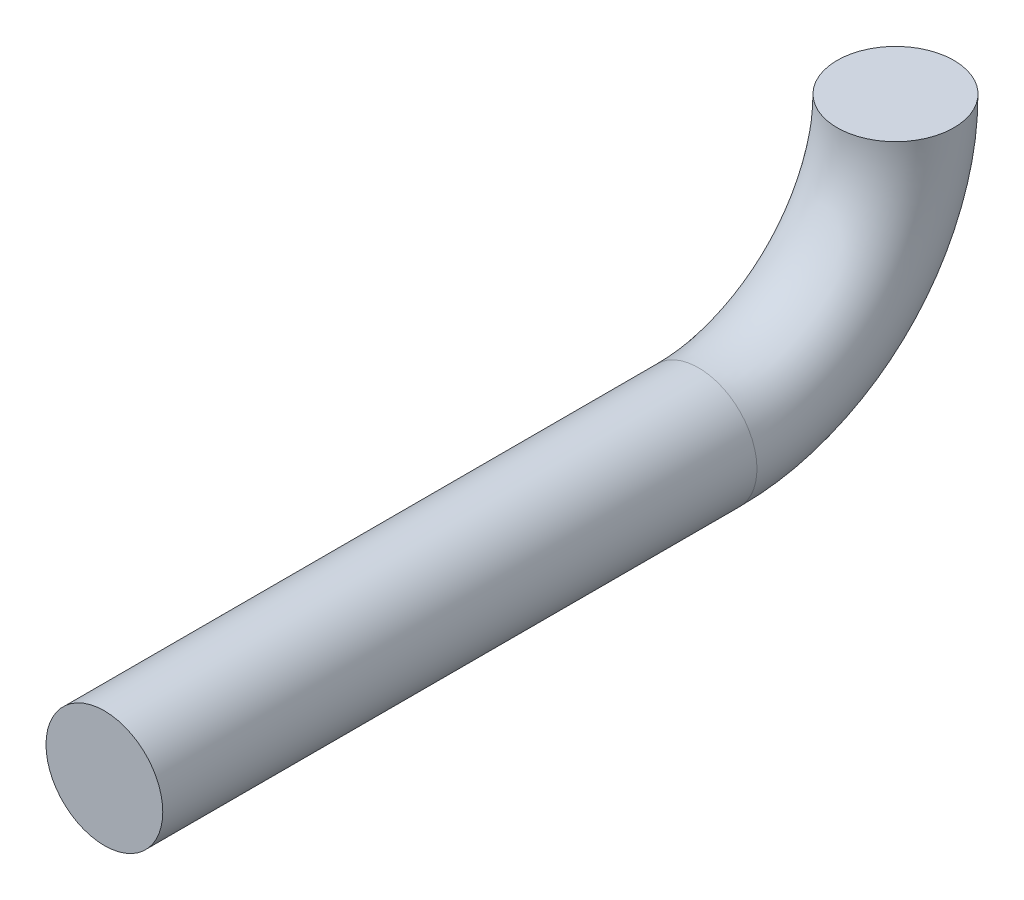
ISO-10303-21;
HEADER;
FILE_DESCRIPTION(('STEP AP214'),'2;1');
FILE_NAME('part.step','',(''),(''),'','','');
FILE_SCHEMA(('AUTOMOTIVE_DESIGN { 1 0 10303 214 1 1 1 1 }'));
ENDSEC;
DATA;
#1=APPLICATION_CONTEXT('core data for automotive mechanical design processes');
#2=APPLICATION_PROTOCOL_DEFINITION('international standard','automotive_design',2000,#1);
#3=PRODUCT_CONTEXT('',#1,'mechanical');
#4=PRODUCT('Part','Part','',(#3));
#5=PRODUCT_RELATED_PRODUCT_CATEGORY('part','',(#4));
#6=PRODUCT_DEFINITION_FORMATION('','',#4);
#7=PRODUCT_DEFINITION_CONTEXT('part definition',#1,'design');
#8=PRODUCT_DEFINITION('design','',#6,#7);
#9=PRODUCT_DEFINITION_SHAPE('','',#8);
#10=(LENGTH_UNIT() NAMED_UNIT(*) SI_UNIT(.MILLI.,.METRE.));
#11=(NAMED_UNIT(*) PLANE_ANGLE_UNIT() SI_UNIT($,.RADIAN.));
#12=(NAMED_UNIT(*) SI_UNIT($,.STERADIAN.) SOLID_ANGLE_UNIT());
#13=UNCERTAINTY_MEASURE_WITH_UNIT(LENGTH_MEASURE(1.E-05),#10,'distance_accuracy_value','');
#14=(GEOMETRIC_REPRESENTATION_CONTEXT(3) GLOBAL_UNCERTAINTY_ASSIGNED_CONTEXT((#13)) GLOBAL_UNIT_ASSIGNED_CONTEXT((#10,
#11,#12)) REPRESENTATION_CONTEXT('',''));
#15=CARTESIAN_POINT('',(0.,0.,0.));
#16=DIRECTION('',(0.,0.,1.));
#17=DIRECTION('',(1.,0.,0.));
#18=AXIS2_PLACEMENT_3D('',#15,#16,#17);
#19=CARTESIAN_POINT('',(0.,0.,-0.856837323203038));
#20=DIRECTION('',(0.,1.,0.));
#21=DIRECTION('',(0.,0.,1.));
#22=AXIS2_PLACEMENT_3D('',#19,#20,#21);
#23=PLANE('',#22);
#24=CARTESIAN_POINT('',(0.,0.,-0.856837323203038));
#25=DIRECTION('',(0.,1.,0.));
#26=DIRECTION('',(0.,0.,1.));
#27=AXIS2_PLACEMENT_3D('',#24,#25,#26);
#28=CIRCLE('',#27,0.254);
#29=CARTESIAN_POINT('',(0.,0.,-1.11083732320304));
#30=VERTEX_POINT('',#29);
#31=EDGE_CURVE('E49',#30,#30,#28,.T.);
#32=ORIENTED_EDGE('',*,*,#31,.T.);
#33=EDGE_LOOP('',(#32));
#34=FACE_BOUND('',#33,.T.);
#35=ADVANCED_FACE('F37',(#34),#23,.T.);
#36=CARTESIAN_POINT('',(0.,-0.856837323203038,2.58498565712537));
#37=DIRECTION('',(0.,0.,-1.));
#38=DIRECTION('',(0.,1.,0.));
#39=AXIS2_PLACEMENT_3D('',#36,#37,#38);
#40=PLANE('',#39);
#41=CARTESIAN_POINT('',(0.,-0.856837323203038,2.58498565712537));
#42=DIRECTION('',(0.,0.,-1.));
#43=DIRECTION('',(0.,1.,0.));
#44=AXIS2_PLACEMENT_3D('',#41,#42,#43);
#45=CIRCLE('',#44,0.254);
#46=CARTESIAN_POINT('',(0.,-0.602837323203038,2.58498565712537));
#47=VERTEX_POINT('',#46);
#48=EDGE_CURVE('E10',#47,#47,#45,.T.);
#49=ORIENTED_EDGE('',*,*,#48,.F.);
#50=EDGE_LOOP('',(#49));
#51=FACE_BOUND('',#50,.T.);
#52=ADVANCED_FACE('F61',(#51),#40,.F.);
#53=CARTESIAN_POINT('',(0.,0.,0.));
#54=DIRECTION('',(-1.,0.,0.));
#55=DIRECTION('',(0.,0.,1.));
#56=AXIS2_PLACEMENT_3D('',#53,#54,#55);
#57=TOROIDAL_SURFACE('',#56,0.856837323203038,0.254);
#58=CARTESIAN_POINT('',(0.,-0.856837323203038,0.));
#59=DIRECTION('',(0.,0.,-1.));
#60=DIRECTION('',(0.,1.,0.));
#61=AXIS2_PLACEMENT_3D('',#58,#59,#60);
#62=CIRCLE('',#61,0.254);
#63=CARTESIAN_POINT('',(0.,-1.11083732320304,0.));
#64=VERTEX_POINT('',#63);
#65=EDGE_CURVE('E44',#64,#64,#62,.T.);
#66=CARTESIAN_POINT('',(0.,0.,0.));
#67=DIRECTION('',(-1.,0.,0.));
#68=DIRECTION('',(0.,0.,1.));
#69=AXIS2_PLACEMENT_3D('',#66,#67,#68);
#70=CIRCLE('',#69,1.11083732320304);
#71=EDGE_CURVE('',#30,#64,#70,.T.);
#72=ORIENTED_EDGE('',*,*,#31,.F.);
#73=ORIENTED_EDGE('',*,*,#65,.T.);
#74=ORIENTED_EDGE('',*,*,#71,.T.);
#75=ORIENTED_EDGE('',*,*,#71,.F.);
#76=EDGE_LOOP('',(#72,#74,#73,#75));
#77=FACE_BOUND('',#76,.T.);
#78=ADVANCED_FACE('F58',(#77),#57,.T.);
#79=CARTESIAN_POINT('',(0.,-0.856837323203038,0.));
#80=DIRECTION('',(0.,0.,1.));
#81=DIRECTION('',(1.,0.,0.));
#82=AXIS2_PLACEMENT_3D('',#79,#80,#81);
#83=CYLINDRICAL_SURFACE('',#82,0.254);
#84=ORIENTED_EDGE('',*,*,#48,.T.);
#85=EDGE_LOOP('',(#84));
#86=FACE_BOUND('',#85,.T.);
#87=ORIENTED_EDGE('',*,*,#65,.F.);
#88=EDGE_LOOP('',(#87));
#89=FACE_BOUND('',#88,.T.);
#90=ADVANCED_FACE('F60',(#86,#89),#83,.T.);
#91=CLOSED_SHELL('',(#35,#52,#78,#90));
#92=MANIFOLD_SOLID_BREP('B2',#91);
#93=ADVANCED_BREP_SHAPE_REPRESENTATION('',(#18,#92),#14);
#94=SHAPE_DEFINITION_REPRESENTATION(#9,#93);
ENDSEC;
END-ISO-10303-21;
